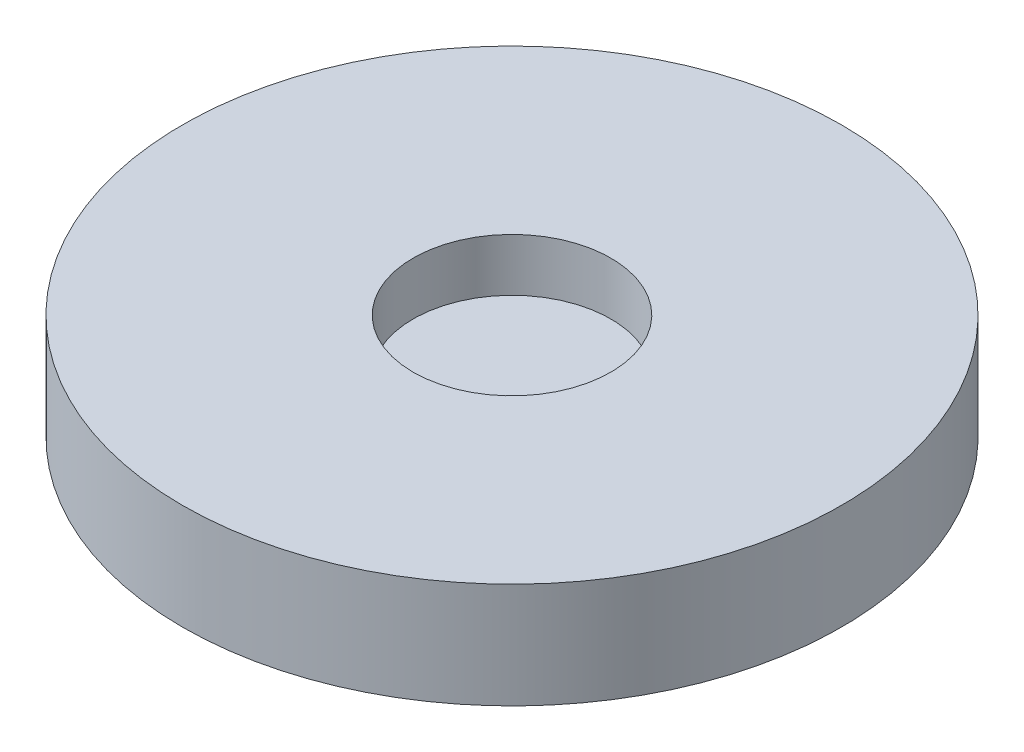
ISO-10303-21;
HEADER;
FILE_DESCRIPTION(('STEP AP214'),'2;1');
FILE_NAME('part.step','',(''),(''),'','','');
FILE_SCHEMA(('AUTOMOTIVE_DESIGN { 1 0 10303 214 1 1 1 1 }'));
ENDSEC;
DATA;
#1=APPLICATION_CONTEXT('core data for automotive mechanical design processes');
#2=APPLICATION_PROTOCOL_DEFINITION('international standard','automotive_design',2000,#1);
#3=PRODUCT_CONTEXT('',#1,'mechanical');
#4=PRODUCT('Part','Part','',(#3));
#5=PRODUCT_RELATED_PRODUCT_CATEGORY('part','',(#4));
#6=PRODUCT_DEFINITION_FORMATION('','',#4);
#7=PRODUCT_DEFINITION_CONTEXT('part definition',#1,'design');
#8=PRODUCT_DEFINITION('design','',#6,#7);
#9=PRODUCT_DEFINITION_SHAPE('','',#8);
#10=(LENGTH_UNIT() NAMED_UNIT(*) SI_UNIT(.MILLI.,.METRE.));
#11=(NAMED_UNIT(*) PLANE_ANGLE_UNIT() SI_UNIT($,.RADIAN.));
#12=(NAMED_UNIT(*) SI_UNIT($,.STERADIAN.) SOLID_ANGLE_UNIT());
#13=UNCERTAINTY_MEASURE_WITH_UNIT(LENGTH_MEASURE(1.E-05),#10,'distance_accuracy_value','');
#14=(GEOMETRIC_REPRESENTATION_CONTEXT(3) GLOBAL_UNCERTAINTY_ASSIGNED_CONTEXT((#13)) GLOBAL_UNIT_ASSIGNED_CONTEXT((#10,
#11,#12)) REPRESENTATION_CONTEXT('',''));
#15=CARTESIAN_POINT('',(0.,0.,0.));
#16=DIRECTION('',(0.,0.,1.));
#17=DIRECTION('',(1.,0.,0.));
#18=AXIS2_PLACEMENT_3D('',#15,#16,#17);
#19=CARTESIAN_POINT('',(0.,8.,0.));
#20=DIRECTION('',(0.,-1.,0.));
#21=DIRECTION('',(0.,0.,-1.));
#22=AXIS2_PLACEMENT_3D('',#19,#20,#21);
#23=CYLINDRICAL_SURFACE('',#22,25.);
#24=CARTESIAN_POINT('',(0.,8.,0.));
#25=DIRECTION('',(0.,1.,0.));
#26=DIRECTION('',(0.,0.,1.));
#27=AXIS2_PLACEMENT_3D('',#24,#25,#26);
#28=CIRCLE('',#27,25.);
#29=CARTESIAN_POINT('',(0.,8.,25.));
#30=VERTEX_POINT('',#29);
#31=EDGE_CURVE('E10',#30,#30,#28,.T.);
#32=ORIENTED_EDGE('',*,*,#31,.F.);
#33=EDGE_LOOP('',(#32));
#34=FACE_BOUND('',#33,.T.);
#35=CARTESIAN_POINT('',(0.,0.,0.));
#36=DIRECTION('',(0.,1.,0.));
#37=DIRECTION('',(0.,0.,1.));
#38=AXIS2_PLACEMENT_3D('',#35,#36,#37);
#39=CIRCLE('',#38,25.);
#40=CARTESIAN_POINT('',(0.,0.,25.));
#41=VERTEX_POINT('',#40);
#42=EDGE_CURVE('E42',#41,#41,#39,.T.);
#43=ORIENTED_EDGE('',*,*,#42,.T.);
#44=EDGE_LOOP('',(#43));
#45=FACE_BOUND('',#44,.T.);
#46=ADVANCED_FACE('F39',(#34,#45),#23,.T.);
#47=CARTESIAN_POINT('',(0.,8.,0.));
#48=DIRECTION('',(0.,1.,0.));
#49=DIRECTION('',(0.,0.,1.));
#50=AXIS2_PLACEMENT_3D('',#47,#48,#49);
#51=PLANE('',#50);
#52=CARTESIAN_POINT('',(0.,8.,0.));
#53=DIRECTION('',(0.,1.,0.));
#54=DIRECTION('',(0.,0.,1.));
#55=AXIS2_PLACEMENT_3D('',#52,#53,#54);
#56=CIRCLE('',#55,7.5);
#57=CARTESIAN_POINT('',(0.,8.,7.5));
#58=VERTEX_POINT('',#57);
#59=EDGE_CURVE('E51',#58,#58,#56,.T.);
#60=ORIENTED_EDGE('',*,*,#59,.F.);
#61=EDGE_LOOP('',(#60));
#62=FACE_BOUND('',#61,.T.);
#63=ORIENTED_EDGE('',*,*,#31,.T.);
#64=EDGE_LOOP('',(#63));
#65=FACE_BOUND('',#64,.T.);
#66=ADVANCED_FACE('F66',(#62,#65),#51,.T.);
#67=CARTESIAN_POINT('',(0.,0.,0.));
#68=DIRECTION('',(0.,1.,0.));
#69=DIRECTION('',(0.,0.,1.));
#70=AXIS2_PLACEMENT_3D('',#67,#68,#69);
#71=PLANE('',#70);
#72=ORIENTED_EDGE('',*,*,#42,.F.);
#73=EDGE_LOOP('',(#72));
#74=FACE_BOUND('',#73,.T.);
#75=ADVANCED_FACE('F62',(#74),#71,.F.);
#76=CARTESIAN_POINT('',(0.,4.,0.));
#77=DIRECTION('',(0.,1.,0.));
#78=DIRECTION('',(0.,0.,1.));
#79=AXIS2_PLACEMENT_3D('',#76,#77,#78);
#80=CYLINDRICAL_SURFACE('',#79,7.5);
#81=CARTESIAN_POINT('',(0.,4.,0.));
#82=DIRECTION('',(0.,1.,0.));
#83=DIRECTION('',(0.,0.,1.));
#84=AXIS2_PLACEMENT_3D('',#81,#82,#83);
#85=CIRCLE('',#84,7.5);
#86=CARTESIAN_POINT('',(0.,4.,7.5));
#87=VERTEX_POINT('',#86);
#88=EDGE_CURVE('E49',#87,#87,#85,.T.);
#89=ORIENTED_EDGE('',*,*,#88,.F.);
#90=EDGE_LOOP('',(#89));
#91=FACE_BOUND('',#90,.T.);
#92=ORIENTED_EDGE('',*,*,#59,.T.);
#93=EDGE_LOOP('',(#92));
#94=FACE_BOUND('',#93,.T.);
#95=ADVANCED_FACE('F59',(#91,#94),#80,.F.);
#96=CARTESIAN_POINT('',(0.,4.,0.));
#97=DIRECTION('',(0.,1.,0.));
#98=DIRECTION('',(0.,0.,1.));
#99=AXIS2_PLACEMENT_3D('',#96,#97,#98);
#100=PLANE('',#99);
#101=ORIENTED_EDGE('',*,*,#88,.T.);
#102=EDGE_LOOP('',(#101));
#103=FACE_BOUND('',#102,.T.);
#104=ADVANCED_FACE('F57',(#103),#100,.T.);
#105=CLOSED_SHELL('',(#46,#66,#75,#95,#104));
#106=MANIFOLD_SOLID_BREP('B2',#105);
#107=ADVANCED_BREP_SHAPE_REPRESENTATION('',(#18,#106),#14);
#108=SHAPE_DEFINITION_REPRESENTATION(#9,#107);
ENDSEC;
END-ISO-10303-21;
